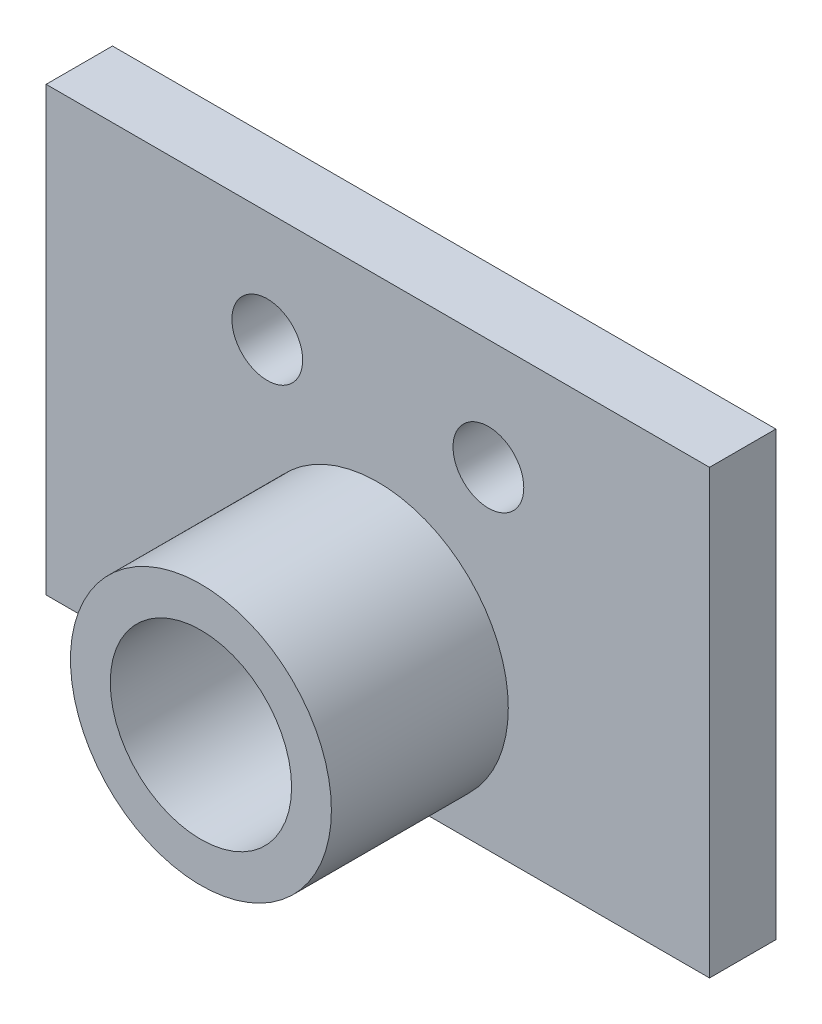
ISO-10303-21;
HEADER;
FILE_DESCRIPTION(('STEP AP214'),'2;1');
FILE_NAME('part.step','',(''),(''),'','','');
FILE_SCHEMA(('AUTOMOTIVE_DESIGN { 1 0 10303 214 1 1 1 1 }'));
ENDSEC;
DATA;
#1=APPLICATION_CONTEXT('core data for automotive mechanical design processes');
#2=APPLICATION_PROTOCOL_DEFINITION('international standard','automotive_design',2000,#1);
#3=PRODUCT_CONTEXT('',#1,'mechanical');
#4=PRODUCT('Part','Part','',(#3));
#5=PRODUCT_RELATED_PRODUCT_CATEGORY('part','',(#4));
#6=PRODUCT_DEFINITION_FORMATION('','',#4);
#7=PRODUCT_DEFINITION_CONTEXT('part definition',#1,'design');
#8=PRODUCT_DEFINITION('design','',#6,#7);
#9=PRODUCT_DEFINITION_SHAPE('','',#8);
#10=(LENGTH_UNIT() NAMED_UNIT(*) SI_UNIT(.MILLI.,.METRE.));
#11=(NAMED_UNIT(*) PLANE_ANGLE_UNIT() SI_UNIT($,.RADIAN.));
#12=(NAMED_UNIT(*) SI_UNIT($,.STERADIAN.) SOLID_ANGLE_UNIT());
#13=UNCERTAINTY_MEASURE_WITH_UNIT(LENGTH_MEASURE(1.E-05),#10,'distance_accuracy_value','');
#14=(GEOMETRIC_REPRESENTATION_CONTEXT(3) GLOBAL_UNCERTAINTY_ASSIGNED_CONTEXT((#13)) GLOBAL_UNIT_ASSIGNED_CONTEXT((#10,
#11,#12)) REPRESENTATION_CONTEXT('',''));
#15=CARTESIAN_POINT('',(0.,0.,0.));
#16=DIRECTION('',(0.,0.,1.));
#17=DIRECTION('',(1.,0.,0.));
#18=AXIS2_PLACEMENT_3D('',#15,#16,#17);
#19=CARTESIAN_POINT('',(0.,0.,3.));
#20=DIRECTION('',(0.,0.,1.));
#21=DIRECTION('',(1.,0.,0.));
#22=AXIS2_PLACEMENT_3D('',#19,#20,#21);
#23=PLANE('',#22);
#24=CARTESIAN_POINT('',(-8.61217484862662,31.048923764784,3.));
#25=DIRECTION('',(0.,0.,1.));
#26=DIRECTION('',(1.,0.,0.));
#27=AXIS2_PLACEMENT_3D('',#24,#25,#26);
#28=CIRCLE('',#27,1.6);
#29=CARTESIAN_POINT('',(-7.01217484862662,31.048923764784,3.));
#30=VERTEX_POINT('',#29);
#31=EDGE_CURVE('E122',#30,#30,#28,.T.);
#32=ORIENTED_EDGE('',*,*,#31,.F.);
#33=EDGE_LOOP('',(#32));
#34=FACE_BOUND('',#33,.T.);
#35=DIRECTION('',(0.,-1.,0.));
#36=VECTOR('',#35,1.);
#37=CARTESIAN_POINT('',(-18.6121748486266,36.048923764784,3.));
#38=LINE('',#37,#36);
#39=CARTESIAN_POINT('',(-18.6121748486266,36.048923764784,3.));
#40=VERTEX_POINT('',#39);
#41=CARTESIAN_POINT('',(-18.6121748486266,16.048923764784,3.));
#42=VERTEX_POINT('',#41);
#43=EDGE_CURVE('E102',#40,#42,#38,.T.);
#44=ORIENTED_EDGE('',*,*,#43,.T.);
#45=DIRECTION('',(1.,0.,0.));
#46=VECTOR('',#45,1.);
#47=CARTESIAN_POINT('',(-18.6121748486266,16.048923764784,3.));
#48=LINE('',#47,#46);
#49=CARTESIAN_POINT('',(11.3878251513734,16.048923764784,3.));
#50=VERTEX_POINT('',#49);
#51=EDGE_CURVE('E97',#42,#50,#48,.T.);
#52=ORIENTED_EDGE('',*,*,#51,.T.);
#53=DIRECTION('',(0.,1.,0.));
#54=VECTOR('',#53,1.);
#55=CARTESIAN_POINT('',(11.3878251513734,36.048923764784,3.));
#56=LINE('',#55,#54);
#57=CARTESIAN_POINT('',(11.3878251513734,36.048923764784,3.));
#58=VERTEX_POINT('',#57);
#59=EDGE_CURVE('E100',#50,#58,#56,.T.);
#60=ORIENTED_EDGE('',*,*,#59,.T.);
#61=DIRECTION('',(-1.,0.,0.));
#62=VECTOR('',#61,1.);
#63=CARTESIAN_POINT('',(-18.6121748486266,36.048923764784,3.));
#64=LINE('',#63,#62);
#65=EDGE_CURVE('E67',#58,#40,#64,.T.);
#66=ORIENTED_EDGE('',*,*,#65,.T.);
#67=EDGE_LOOP('',(#44,#52,#60,#66));
#68=FACE_BOUND('',#67,.T.);
#69=CARTESIAN_POINT('',(1.38782515137338,31.048923764784,3.));
#70=DIRECTION('',(0.,0.,1.));
#71=DIRECTION('',(1.,0.,0.));
#72=AXIS2_PLACEMENT_3D('',#69,#70,#71);
#73=CIRCLE('',#72,1.6);
#74=CARTESIAN_POINT('',(2.98782515137338,31.048923764784,3.));
#75=VERTEX_POINT('',#74);
#76=EDGE_CURVE('E144',#75,#75,#73,.T.);
#77=ORIENTED_EDGE('',*,*,#76,.F.);
#78=EDGE_LOOP('',(#77));
#79=FACE_BOUND('',#78,.T.);
#80=CARTESIAN_POINT('',(-3.61217484862661,22.0732064330687,3.));
#81=DIRECTION('',(0.,0.,1.));
#82=DIRECTION('',(1.,0.,0.));
#83=AXIS2_PLACEMENT_3D('',#80,#81,#82);
#84=CIRCLE('',#83,5.9);
#85=CARTESIAN_POINT('',(2.28782515137338,22.0732064330687,3.));
#86=VERTEX_POINT('',#85);
#87=EDGE_CURVE('E160',#86,#86,#84,.T.);
#88=ORIENTED_EDGE('',*,*,#87,.F.);
#89=EDGE_LOOP('',(#88));
#90=FACE_BOUND('',#89,.T.);
#91=ADVANCED_FACE('F49',(#34,#68,#79,#90),#23,.T.);
#92=CARTESIAN_POINT('',(0.,0.,0.));
#93=DIRECTION('',(0.,0.,1.));
#94=DIRECTION('',(1.,0.,0.));
#95=AXIS2_PLACEMENT_3D('',#92,#93,#94);
#96=PLANE('',#95);
#97=DIRECTION('',(0.,-1.,0.));
#98=VECTOR('',#97,1.);
#99=CARTESIAN_POINT('',(-18.6121748486266,36.048923764784,0.));
#100=LINE('',#99,#98);
#101=CARTESIAN_POINT('',(-18.6121748486266,36.048923764784,0.));
#102=VERTEX_POINT('',#101);
#103=CARTESIAN_POINT('',(-18.6121748486266,16.048923764784,0.));
#104=VERTEX_POINT('',#103);
#105=EDGE_CURVE('E118',#102,#104,#100,.T.);
#106=ORIENTED_EDGE('',*,*,#105,.F.);
#107=DIRECTION('',(-1.,0.,0.));
#108=VECTOR('',#107,1.);
#109=CARTESIAN_POINT('',(-18.6121748486266,36.048923764784,0.));
#110=LINE('',#109,#108);
#111=CARTESIAN_POINT('',(11.3878251513734,36.048923764784,0.));
#112=VERTEX_POINT('',#111);
#113=EDGE_CURVE('E90',#112,#102,#110,.T.);
#114=ORIENTED_EDGE('',*,*,#113,.F.);
#115=DIRECTION('',(0.,1.,0.));
#116=VECTOR('',#115,1.);
#117=CARTESIAN_POINT('',(11.3878251513734,36.048923764784,0.));
#118=LINE('',#117,#116);
#119=CARTESIAN_POINT('',(11.3878251513734,16.048923764784,0.));
#120=VERTEX_POINT('',#119);
#121=EDGE_CURVE('E84',#120,#112,#118,.T.);
#122=ORIENTED_EDGE('',*,*,#121,.F.);
#123=DIRECTION('',(1.,0.,0.));
#124=VECTOR('',#123,1.);
#125=CARTESIAN_POINT('',(-18.6121748486266,16.048923764784,0.));
#126=LINE('',#125,#124);
#127=EDGE_CURVE('E107',#104,#120,#126,.T.);
#128=ORIENTED_EDGE('',*,*,#127,.F.);
#129=EDGE_LOOP('',(#106,#114,#122,#128));
#130=FACE_BOUND('',#129,.T.);
#131=CARTESIAN_POINT('',(-8.61217484862662,31.048923764784,0.));
#132=DIRECTION('',(0.,0.,1.));
#133=DIRECTION('',(1.,0.,0.));
#134=AXIS2_PLACEMENT_3D('',#131,#132,#133);
#135=CIRCLE('',#134,1.6);
#136=CARTESIAN_POINT('',(-7.01217484862662,31.048923764784,0.));
#137=VERTEX_POINT('',#136);
#138=EDGE_CURVE('E140',#137,#137,#135,.T.);
#139=ORIENTED_EDGE('',*,*,#138,.T.);
#140=EDGE_LOOP('',(#139));
#141=FACE_BOUND('',#140,.T.);
#142=CARTESIAN_POINT('',(1.38782515137338,31.048923764784,0.));
#143=DIRECTION('',(0.,0.,1.));
#144=DIRECTION('',(1.,0.,0.));
#145=AXIS2_PLACEMENT_3D('',#142,#143,#144);
#146=CIRCLE('',#145,1.6);
#147=CARTESIAN_POINT('',(2.98782515137338,31.048923764784,0.));
#148=VERTEX_POINT('',#147);
#149=EDGE_CURVE('E148',#148,#148,#146,.T.);
#150=ORIENTED_EDGE('',*,*,#149,.T.);
#151=EDGE_LOOP('',(#150));
#152=FACE_BOUND('',#151,.T.);
#153=CARTESIAN_POINT('',(-3.61217484862661,22.0732064330687,0.));
#154=DIRECTION('',(0.,0.,1.));
#155=DIRECTION('',(1.,0.,0.));
#156=AXIS2_PLACEMENT_3D('',#153,#154,#155);
#157=CIRCLE('',#156,4.1);
#158=CARTESIAN_POINT('',(0.487825151373385,22.0732064330687,0.));
#159=VERTEX_POINT('',#158);
#160=EDGE_CURVE('E152',#159,#159,#157,.T.);
#161=ORIENTED_EDGE('',*,*,#160,.T.);
#162=EDGE_LOOP('',(#161));
#163=FACE_BOUND('',#162,.T.);
#164=ADVANCED_FACE('F135',(#130,#141,#152,#163),#96,.F.);
#165=CARTESIAN_POINT('',(-18.6121748486266,36.048923764784,3.));
#166=DIRECTION('',(1.,0.,0.));
#167=DIRECTION('',(0.,0.,-1.));
#168=AXIS2_PLACEMENT_3D('',#165,#166,#167);
#169=PLANE('',#168);
#170=ORIENTED_EDGE('',*,*,#105,.T.);
#171=DIRECTION('',(0.,0.,-1.));
#172=VECTOR('',#171,1.);
#173=CARTESIAN_POINT('',(-18.6121748486266,16.048923764784,3.));
#174=LINE('',#173,#172);
#175=EDGE_CURVE('E12',#42,#104,#174,.T.);
#176=ORIENTED_EDGE('',*,*,#175,.F.);
#177=ORIENTED_EDGE('',*,*,#43,.F.);
#178=DIRECTION('',(0.,0.,-1.));
#179=VECTOR('',#178,1.);
#180=CARTESIAN_POINT('',(-18.6121748486266,36.048923764784,3.));
#181=LINE('',#180,#179);
#182=EDGE_CURVE('E114',#40,#102,#181,.T.);
#183=ORIENTED_EDGE('',*,*,#182,.T.);
#184=EDGE_LOOP('',(#170,#176,#177,#183));
#185=FACE_BOUND('',#184,.T.);
#186=ADVANCED_FACE('F51',(#185),#169,.F.);
#187=CARTESIAN_POINT('',(-18.6121748486266,16.048923764784,3.));
#188=DIRECTION('',(0.,1.,0.));
#189=DIRECTION('',(-1.,0.,0.));
#190=AXIS2_PLACEMENT_3D('',#187,#188,#189);
#191=PLANE('',#190);
#192=ORIENTED_EDGE('',*,*,#127,.T.);
#193=DIRECTION('',(0.,0.,-1.));
#194=VECTOR('',#193,1.);
#195=CARTESIAN_POINT('',(11.3878251513734,16.048923764784,3.));
#196=LINE('',#195,#194);
#197=EDGE_CURVE('E59',#50,#120,#196,.T.);
#198=ORIENTED_EDGE('',*,*,#197,.F.);
#199=ORIENTED_EDGE('',*,*,#51,.F.);
#200=ORIENTED_EDGE('',*,*,#175,.T.);
#201=EDGE_LOOP('',(#192,#198,#199,#200));
#202=FACE_BOUND('',#201,.T.);
#203=ADVANCED_FACE('F106',(#202),#191,.F.);
#204=CARTESIAN_POINT('',(11.3878251513734,36.048923764784,3.));
#205=DIRECTION('',(-1.,0.,0.));
#206=DIRECTION('',(0.,-1.,0.));
#207=AXIS2_PLACEMENT_3D('',#204,#205,#206);
#208=PLANE('',#207);
#209=ORIENTED_EDGE('',*,*,#121,.T.);
#210=DIRECTION('',(0.,0.,-1.));
#211=VECTOR('',#210,1.);
#212=CARTESIAN_POINT('',(11.3878251513734,36.048923764784,3.));
#213=LINE('',#212,#211);
#214=EDGE_CURVE('E109',#58,#112,#213,.T.);
#215=ORIENTED_EDGE('',*,*,#214,.F.);
#216=ORIENTED_EDGE('',*,*,#59,.F.);
#217=ORIENTED_EDGE('',*,*,#197,.T.);
#218=EDGE_LOOP('',(#209,#215,#216,#217));
#219=FACE_BOUND('',#218,.T.);
#220=ADVANCED_FACE('F110',(#219),#208,.F.);
#221=CARTESIAN_POINT('',(-18.6121748486266,36.048923764784,3.));
#222=DIRECTION('',(0.,-1.,0.));
#223=DIRECTION('',(1.,0.,0.));
#224=AXIS2_PLACEMENT_3D('',#221,#222,#223);
#225=PLANE('',#224);
#226=ORIENTED_EDGE('',*,*,#113,.T.);
#227=ORIENTED_EDGE('',*,*,#182,.F.);
#228=ORIENTED_EDGE('',*,*,#65,.F.);
#229=ORIENTED_EDGE('',*,*,#214,.T.);
#230=EDGE_LOOP('',(#226,#227,#228,#229));
#231=FACE_BOUND('',#230,.T.);
#232=ADVANCED_FACE('F132',(#231),#225,.F.);
#233=CARTESIAN_POINT('',(-8.61217484862662,31.048923764784,3.));
#234=DIRECTION('',(0.,0.,-1.));
#235=DIRECTION('',(-1.,0.,0.));
#236=AXIS2_PLACEMENT_3D('',#233,#234,#235);
#237=CYLINDRICAL_SURFACE('',#236,1.6);
#238=ORIENTED_EDGE('',*,*,#31,.T.);
#239=EDGE_LOOP('',(#238));
#240=FACE_BOUND('',#239,.T.);
#241=ORIENTED_EDGE('',*,*,#138,.F.);
#242=EDGE_LOOP('',(#241));
#243=FACE_BOUND('',#242,.T.);
#244=ADVANCED_FACE('F197',(#240,#243),#237,.F.);
#245=CARTESIAN_POINT('',(1.38782515137338,31.048923764784,3.));
#246=DIRECTION('',(0.,0.,-1.));
#247=DIRECTION('',(-1.,0.,0.));
#248=AXIS2_PLACEMENT_3D('',#245,#246,#247);
#249=CYLINDRICAL_SURFACE('',#248,1.6);
#250=ORIENTED_EDGE('',*,*,#76,.T.);
#251=EDGE_LOOP('',(#250));
#252=FACE_BOUND('',#251,.T.);
#253=ORIENTED_EDGE('',*,*,#149,.F.);
#254=EDGE_LOOP('',(#253));
#255=FACE_BOUND('',#254,.T.);
#256=ADVANCED_FACE('F185',(#252,#255),#249,.F.);
#257=CARTESIAN_POINT('',(-3.61217484862661,22.0732064330687,3.));
#258=DIRECTION('',(0.,0.,-1.));
#259=DIRECTION('',(-1.,0.,0.));
#260=AXIS2_PLACEMENT_3D('',#257,#258,#259);
#261=CYLINDRICAL_SURFACE('',#260,4.1);
#262=ORIENTED_EDGE('',*,*,#160,.F.);
#263=EDGE_LOOP('',(#262));
#264=FACE_BOUND('',#263,.T.);
#265=CARTESIAN_POINT('',(-3.61217484862661,22.0732064330687,11.));
#266=DIRECTION('',(0.,0.,1.));
#267=DIRECTION('',(1.,0.,0.));
#268=AXIS2_PLACEMENT_3D('',#265,#266,#267);
#269=CIRCLE('',#268,4.1);
#270=CARTESIAN_POINT('',(0.487825151373385,22.0732064330687,11.));
#271=VERTEX_POINT('',#270);
#272=EDGE_CURVE('E164',#271,#271,#269,.T.);
#273=ORIENTED_EDGE('',*,*,#272,.T.);
#274=EDGE_LOOP('',(#273));
#275=FACE_BOUND('',#274,.T.);
#276=ADVANCED_FACE('F172',(#264,#275),#261,.F.);
#277=CARTESIAN_POINT('',(-3.61217484862661,22.0732064330687,11.));
#278=DIRECTION('',(0.,0.,1.));
#279=DIRECTION('',(1.,0.,0.));
#280=AXIS2_PLACEMENT_3D('',#277,#278,#279);
#281=PLANE('',#280);
#282=CARTESIAN_POINT('',(-3.61217484862661,22.0732064330687,11.));
#283=DIRECTION('',(0.,0.,1.));
#284=DIRECTION('',(1.,0.,0.));
#285=AXIS2_PLACEMENT_3D('',#282,#283,#284);
#286=CIRCLE('',#285,5.9);
#287=CARTESIAN_POINT('',(2.28782515137338,22.0732064330687,11.));
#288=VERTEX_POINT('',#287);
#289=EDGE_CURVE('E159',#288,#288,#286,.T.);
#290=ORIENTED_EDGE('',*,*,#289,.T.);
#291=EDGE_LOOP('',(#290));
#292=FACE_BOUND('',#291,.T.);
#293=ORIENTED_EDGE('',*,*,#272,.F.);
#294=EDGE_LOOP('',(#293));
#295=FACE_BOUND('',#294,.T.);
#296=ADVANCED_FACE('F174',(#292,#295),#281,.T.);
#297=CARTESIAN_POINT('',(-3.61217484862661,22.0732064330687,11.));
#298=DIRECTION('',(0.,0.,-1.));
#299=DIRECTION('',(-1.,0.,0.));
#300=AXIS2_PLACEMENT_3D('',#297,#298,#299);
#301=CYLINDRICAL_SURFACE('',#300,5.9);
#302=ORIENTED_EDGE('',*,*,#289,.F.);
#303=EDGE_LOOP('',(#302));
#304=FACE_BOUND('',#303,.T.);
#305=ORIENTED_EDGE('',*,*,#87,.T.);
#306=EDGE_LOOP('',(#305));
#307=FACE_BOUND('',#306,.T.);
#308=ADVANCED_FACE('F176',(#304,#307),#301,.T.);
#309=CLOSED_SHELL('',(#91,#164,#186,#203,#220,#232,#244,#256,#276,#296,#308));
#310=MANIFOLD_SOLID_BREP('B2',#309);
#311=ADVANCED_BREP_SHAPE_REPRESENTATION('',(#18,#310),#14);
#312=SHAPE_DEFINITION_REPRESENTATION(#9,#311);
ENDSEC;
END-ISO-10303-21;
